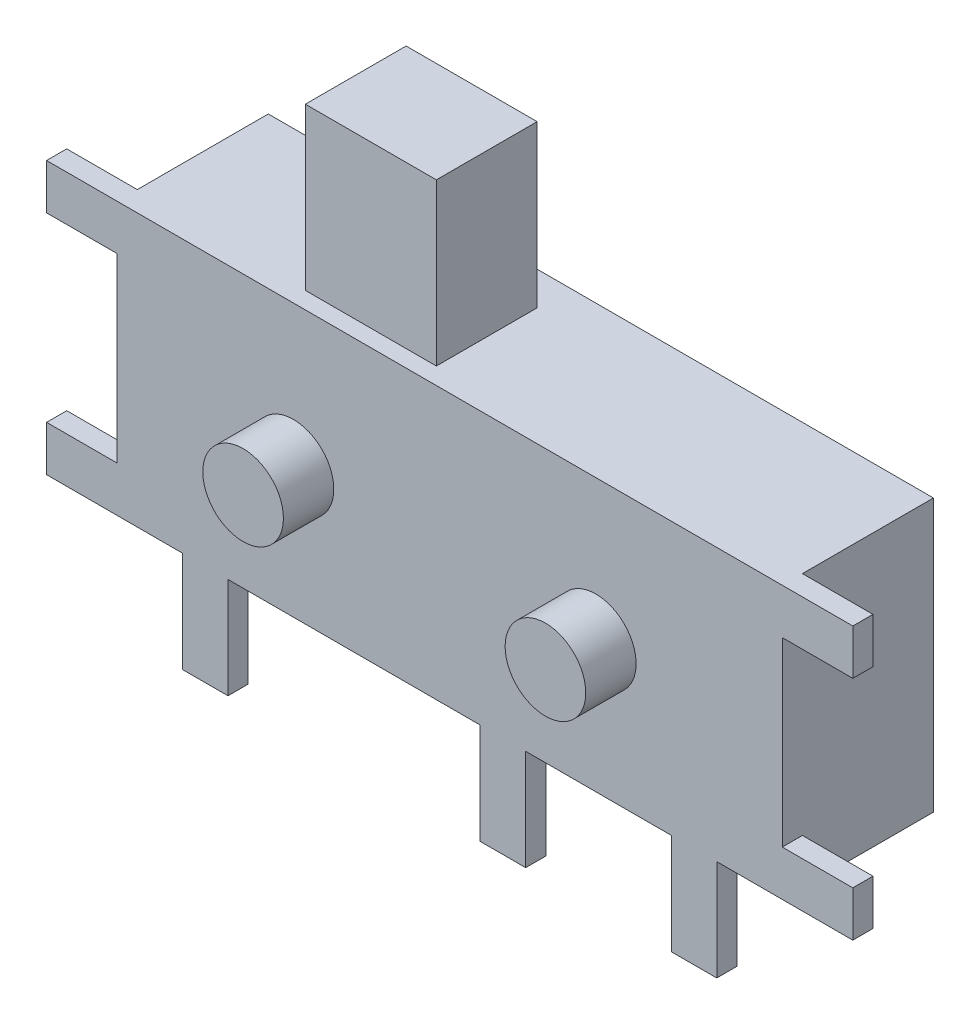
ISO-10303-21;
HEADER;
FILE_DESCRIPTION(('STEP AP214'),'2;1');
FILE_NAME('part.step','',(''),(''),'','','');
FILE_SCHEMA(('AUTOMOTIVE_DESIGN { 1 0 10303 214 1 1 1 1 }'));
ENDSEC;
DATA;
#1=APPLICATION_CONTEXT('core data for automotive mechanical design processes');
#2=APPLICATION_PROTOCOL_DEFINITION('international standard','automotive_design',2000,#1);
#3=PRODUCT_CONTEXT('',#1,'mechanical');
#4=PRODUCT('Part','Part','',(#3));
#5=PRODUCT_RELATED_PRODUCT_CATEGORY('part','',(#4));
#6=PRODUCT_DEFINITION_FORMATION('','',#4);
#7=PRODUCT_DEFINITION_CONTEXT('part definition',#1,'design');
#8=PRODUCT_DEFINITION('design','',#6,#7);
#9=PRODUCT_DEFINITION_SHAPE('','',#8);
#10=(LENGTH_UNIT() NAMED_UNIT(*) SI_UNIT(.MILLI.,.METRE.));
#11=(NAMED_UNIT(*) PLANE_ANGLE_UNIT() SI_UNIT($,.RADIAN.));
#12=(NAMED_UNIT(*) SI_UNIT($,.STERADIAN.) SOLID_ANGLE_UNIT());
#13=UNCERTAINTY_MEASURE_WITH_UNIT(LENGTH_MEASURE(1.E-05),#10,'distance_accuracy_value','');
#14=(GEOMETRIC_REPRESENTATION_CONTEXT(3) GLOBAL_UNCERTAINTY_ASSIGNED_CONTEXT((#13)) GLOBAL_UNIT_ASSIGNED_CONTEXT((#10,
#11,#12)) REPRESENTATION_CONTEXT('',''));
#15=CARTESIAN_POINT('',(0.,0.,0.));
#16=DIRECTION('',(0.,0.,1.));
#17=DIRECTION('',(1.,0.,0.));
#18=AXIS2_PLACEMENT_3D('',#15,#16,#17);
#19=CARTESIAN_POINT('',(3.3,-1.35,-1.5));
#20=DIRECTION('',(1.,0.,0.));
#21=DIRECTION('',(0.,0.,-1.));
#22=AXIS2_PLACEMENT_3D('',#19,#20,#21);
#23=PLANE('',#22);
#24=DIRECTION('',(0.,0.,1.));
#25=VECTOR('',#24,1.);
#26=CARTESIAN_POINT('',(3.3,-0.900000000000001,-0.2));
#27=LINE('',#26,#25);
#28=CARTESIAN_POINT('',(3.3,-0.900000000000001,-0.2));
#29=VERTEX_POINT('',#28);
#30=CARTESIAN_POINT('',(3.3,-0.900000000000001,0.));
#31=VERTEX_POINT('',#30);
#32=EDGE_CURVE('E403',#29,#31,#27,.T.);
#33=ORIENTED_EDGE('',*,*,#32,.F.);
#34=DIRECTION('',(0.,-1.,0.));
#35=VECTOR('',#34,1.);
#36=CARTESIAN_POINT('',(3.3,-1.35,-0.2));
#37=LINE('',#36,#35);
#38=CARTESIAN_POINT('',(3.3,-1.35,-0.2));
#39=VERTEX_POINT('',#38);
#40=EDGE_CURVE('E386',#29,#39,#37,.T.);
#41=ORIENTED_EDGE('',*,*,#40,.T.);
#42=DIRECTION('',(0.,0.,1.));
#43=VECTOR('',#42,1.);
#44=CARTESIAN_POINT('',(3.3,-1.35,-1.5));
#45=LINE('',#44,#43);
#46=CARTESIAN_POINT('',(3.3,-1.35,-1.5));
#47=VERTEX_POINT('',#46);
#48=EDGE_CURVE('E487',#47,#39,#45,.T.);
#49=ORIENTED_EDGE('',*,*,#48,.F.);
#50=DIRECTION('',(0.,1.,0.));
#51=VECTOR('',#50,1.);
#52=CARTESIAN_POINT('',(3.3,-1.35,-1.5));
#53=LINE('',#52,#51);
#54=CARTESIAN_POINT('',(3.3,1.35,-1.5));
#55=VERTEX_POINT('',#54);
#56=EDGE_CURVE('E462',#47,#55,#53,.T.);
#57=ORIENTED_EDGE('',*,*,#56,.T.);
#58=DIRECTION('',(0.,0.,1.));
#59=VECTOR('',#58,1.);
#60=CARTESIAN_POINT('',(3.3,1.35,-1.5));
#61=LINE('',#60,#59);
#62=CARTESIAN_POINT('',(3.3,1.35,-0.2));
#63=VERTEX_POINT('',#62);
#64=EDGE_CURVE('E475',#55,#63,#61,.T.);
#65=ORIENTED_EDGE('',*,*,#64,.T.);
#66=DIRECTION('',(0.,-1.,0.));
#67=VECTOR('',#66,1.);
#68=CARTESIAN_POINT('',(3.3,1.35,-0.2));
#69=LINE('',#68,#67);
#70=CARTESIAN_POINT('',(3.3,0.9,-0.2));
#71=VERTEX_POINT('',#70);
#72=EDGE_CURVE('E414',#63,#71,#69,.T.);
#73=ORIENTED_EDGE('',*,*,#72,.T.);
#74=DIRECTION('',(0.,0.,1.));
#75=VECTOR('',#74,1.);
#76=CARTESIAN_POINT('',(3.3,0.9,-0.2));
#77=LINE('',#76,#75);
#78=CARTESIAN_POINT('',(3.3,0.899999999999999,0.));
#79=VERTEX_POINT('',#78);
#80=EDGE_CURVE('E424',#71,#79,#77,.T.);
#81=ORIENTED_EDGE('',*,*,#80,.T.);
#82=DIRECTION('',(0.,1.,0.));
#83=VECTOR('',#82,1.);
#84=CARTESIAN_POINT('',(3.3,-1.35,0.));
#85=LINE('',#84,#83);
#86=EDGE_CURVE('E457',#31,#79,#85,.T.);
#87=ORIENTED_EDGE('',*,*,#86,.F.);
#88=EDGE_LOOP('',(#33,#41,#49,#57,#65,#73,#81,#87));
#89=FACE_BOUND('',#88,.T.);
#90=ADVANCED_FACE('F36',(#89),#23,.T.);
#91=CARTESIAN_POINT('',(-3.3,-1.35,-1.5));
#92=DIRECTION('',(0.,-1.,0.));
#93=DIRECTION('',(0.,0.,-1.));
#94=AXIS2_PLACEMENT_3D('',#91,#92,#93);
#95=PLANE('',#94);
#96=DIRECTION('',(0.,0.,1.));
#97=VECTOR('',#96,1.);
#98=CARTESIAN_POINT('',(0.754045219724622,-1.35,-0.2));
#99=LINE('',#98,#97);
#100=CARTESIAN_POINT('',(0.754045219724622,-1.35,-0.2));
#101=VERTEX_POINT('',#100);
#102=CARTESIAN_POINT('',(0.754045219724621,-1.35,0.));
#103=VERTEX_POINT('',#102);
#104=EDGE_CURVE('E284',#101,#103,#99,.T.);
#105=ORIENTED_EDGE('',*,*,#104,.F.);
#106=DIRECTION('',(-1.,0.,0.));
#107=VECTOR('',#106,1.);
#108=CARTESIAN_POINT('',(0.754045219724622,-1.35,-0.2));
#109=LINE('',#108,#107);
#110=CARTESIAN_POINT('',(0.3,-1.35,-0.2));
#111=VERTEX_POINT('',#110);
#112=EDGE_CURVE('E275',#101,#111,#109,.T.);
#113=ORIENTED_EDGE('',*,*,#112,.T.);
#114=DIRECTION('',(0.,0.,1.));
#115=VECTOR('',#114,1.);
#116=CARTESIAN_POINT('',(0.3,-1.35,-0.2));
#117=LINE('',#116,#115);
#118=CARTESIAN_POINT('',(0.3,-1.35,0.));
#119=VERTEX_POINT('',#118);
#120=EDGE_CURVE('E295',#111,#119,#117,.T.);
#121=ORIENTED_EDGE('',*,*,#120,.T.);
#122=DIRECTION('',(1.,0.,0.));
#123=VECTOR('',#122,1.);
#124=CARTESIAN_POINT('',(-3.3,-1.35,0.));
#125=LINE('',#124,#123);
#126=CARTESIAN_POINT('',(-2.2,-1.35,0.));
#127=VERTEX_POINT('',#126);
#128=EDGE_CURVE('E485',#127,#119,#125,.T.);
#129=ORIENTED_EDGE('',*,*,#128,.F.);
#130=DIRECTION('',(0.,0.,1.));
#131=VECTOR('',#130,1.);
#132=CARTESIAN_POINT('',(-2.2,-1.35,-0.2));
#133=LINE('',#132,#131);
#134=CARTESIAN_POINT('',(-2.2,-1.35,-0.2));
#135=VERTEX_POINT('',#134);
#136=EDGE_CURVE('E320',#135,#127,#133,.T.);
#137=ORIENTED_EDGE('',*,*,#136,.F.);
#138=DIRECTION('',(-1.,0.,0.));
#139=VECTOR('',#138,1.);
#140=CARTESIAN_POINT('',(-2.65,-1.35,-0.2));
#141=LINE('',#140,#139);
#142=CARTESIAN_POINT('',(-2.65,-1.35,-0.2));
#143=VERTEX_POINT('',#142);
#144=EDGE_CURVE('E300',#135,#143,#141,.T.);
#145=ORIENTED_EDGE('',*,*,#144,.T.);
#146=DIRECTION('',(0.,0.,1.));
#147=VECTOR('',#146,1.);
#148=CARTESIAN_POINT('',(-2.65,-1.35,-0.2));
#149=LINE('',#148,#147);
#150=CARTESIAN_POINT('',(-2.65,-1.35,0.));
#151=VERTEX_POINT('',#150);
#152=EDGE_CURVE('E313',#143,#151,#149,.T.);
#153=ORIENTED_EDGE('',*,*,#152,.T.);
#154=CARTESIAN_POINT('',(-4.,-1.35,0.));
#155=VERTEX_POINT('',#154);
#156=EDGE_CURVE('E466',#155,#151,#125,.T.);
#157=ORIENTED_EDGE('',*,*,#156,.F.);
#158=DIRECTION('',(0.,0.,1.));
#159=VECTOR('',#158,1.);
#160=CARTESIAN_POINT('',(-4.,-1.35,-0.2));
#161=LINE('',#160,#159);
#162=CARTESIAN_POINT('',(-4.,-1.35,-0.2));
#163=VERTEX_POINT('',#162);
#164=EDGE_CURVE('E378',#163,#155,#161,.T.);
#165=ORIENTED_EDGE('',*,*,#164,.F.);
#166=DIRECTION('',(1.,0.,0.));
#167=VECTOR('',#166,1.);
#168=CARTESIAN_POINT('',(-3.3,-1.35,-0.2));
#169=LINE('',#168,#167);
#170=CARTESIAN_POINT('',(-3.3,-1.35,-0.2));
#171=VERTEX_POINT('',#170);
#172=EDGE_CURVE('E360',#163,#171,#169,.T.);
#173=ORIENTED_EDGE('',*,*,#172,.T.);
#174=DIRECTION('',(0.,0.,1.));
#175=VECTOR('',#174,1.);
#176=CARTESIAN_POINT('',(-3.3,-1.35,-1.5));
#177=LINE('',#176,#175);
#178=CARTESIAN_POINT('',(-3.3,-1.35,-1.5));
#179=VERTEX_POINT('',#178);
#180=EDGE_CURVE('E490',#179,#171,#177,.T.);
#181=ORIENTED_EDGE('',*,*,#180,.F.);
#182=DIRECTION('',(1.,0.,0.));
#183=VECTOR('',#182,1.);
#184=CARTESIAN_POINT('',(-3.3,-1.35,-1.5));
#185=LINE('',#184,#183);
#186=EDGE_CURVE('E472',#179,#47,#185,.T.);
#187=ORIENTED_EDGE('',*,*,#186,.T.);
#188=ORIENTED_EDGE('',*,*,#48,.T.);
#189=DIRECTION('',(1.,0.,0.));
#190=VECTOR('',#189,1.);
#191=CARTESIAN_POINT('',(3.3,-1.35,-0.2));
#192=LINE('',#191,#190);
#193=CARTESIAN_POINT('',(4.,-1.35,-0.2));
#194=VERTEX_POINT('',#193);
#195=EDGE_CURVE('E389',#39,#194,#192,.T.);
#196=ORIENTED_EDGE('',*,*,#195,.T.);
#197=DIRECTION('',(0.,0.,1.));
#198=VECTOR('',#197,1.);
#199=CARTESIAN_POINT('',(4.,-1.35,-0.2));
#200=LINE('',#199,#198);
#201=CARTESIAN_POINT('',(4.,-1.35,0.));
#202=VERTEX_POINT('',#201);
#203=EDGE_CURVE('E399',#194,#202,#200,.T.);
#204=ORIENTED_EDGE('',*,*,#203,.T.);
#205=CARTESIAN_POINT('',(2.65,-1.35,0.));
#206=VERTEX_POINT('',#205);
#207=EDGE_CURVE('E482',#206,#202,#125,.T.);
#208=ORIENTED_EDGE('',*,*,#207,.F.);
#209=DIRECTION('',(0.,0.,1.));
#210=VECTOR('',#209,1.);
#211=CARTESIAN_POINT('',(2.65,-1.35,-0.2));
#212=LINE('',#211,#210);
#213=CARTESIAN_POINT('',(2.65,-1.35,-0.2));
#214=VERTEX_POINT('',#213);
#215=EDGE_CURVE('E343',#214,#206,#212,.T.);
#216=ORIENTED_EDGE('',*,*,#215,.F.);
#217=DIRECTION('',(-1.,0.,0.));
#218=VECTOR('',#217,1.);
#219=CARTESIAN_POINT('',(2.65,-1.35,-0.2));
#220=LINE('',#219,#218);
#221=CARTESIAN_POINT('',(2.2,-1.35,-0.2));
#222=VERTEX_POINT('',#221);
#223=EDGE_CURVE('E333',#214,#222,#220,.T.);
#224=ORIENTED_EDGE('',*,*,#223,.T.);
#225=DIRECTION('',(0.,0.,1.));
#226=VECTOR('',#225,1.);
#227=CARTESIAN_POINT('',(2.2,-1.35,-0.2));
#228=LINE('',#227,#226);
#229=CARTESIAN_POINT('',(2.2,-1.35,0.));
#230=VERTEX_POINT('',#229);
#231=EDGE_CURVE('E356',#222,#230,#228,.T.);
#232=ORIENTED_EDGE('',*,*,#231,.T.);
#233=EDGE_CURVE('E486',#103,#230,#125,.T.);
#234=ORIENTED_EDGE('',*,*,#233,.F.);
#235=EDGE_LOOP('',(#105,#113,#121,#129,#137,#145,#153,#157,#165,#173,#181,#187,#188,#196,#204,
#208,#216,#224,#232,#234));
#236=FACE_BOUND('',#235,.T.);
#237=ADVANCED_FACE('F512',(#236),#95,.T.);
#238=CARTESIAN_POINT('',(-3.3,-1.35,-1.5));
#239=DIRECTION('',(-1.,0.,0.));
#240=DIRECTION('',(0.,0.,1.));
#241=AXIS2_PLACEMENT_3D('',#238,#239,#240);
#242=PLANE('',#241);
#243=DIRECTION('',(0.,0.,1.));
#244=VECTOR('',#243,1.);
#245=CARTESIAN_POINT('',(-3.3,-0.900000000000001,-0.2));
#246=LINE('',#245,#244);
#247=CARTESIAN_POINT('',(-3.3,-0.900000000000001,-0.2));
#248=VERTEX_POINT('',#247);
#249=CARTESIAN_POINT('',(-3.3,-0.900000000000001,0.));
#250=VERTEX_POINT('',#249);
#251=EDGE_CURVE('E373',#248,#250,#246,.T.);
#252=ORIENTED_EDGE('',*,*,#251,.T.);
#253=DIRECTION('',(0.,-1.,0.));
#254=VECTOR('',#253,1.);
#255=CARTESIAN_POINT('',(-3.3,-1.35,0.));
#256=LINE('',#255,#254);
#257=CARTESIAN_POINT('',(-3.3,0.9,0.));
#258=VERTEX_POINT('',#257);
#259=EDGE_CURVE('E479',#258,#250,#256,.T.);
#260=ORIENTED_EDGE('',*,*,#259,.F.);
#261=DIRECTION('',(0.,0.,1.));
#262=VECTOR('',#261,1.);
#263=CARTESIAN_POINT('',(-3.3,0.9,-0.2));
#264=LINE('',#263,#262);
#265=CARTESIAN_POINT('',(-3.3,0.9,-0.2));
#266=VERTEX_POINT('',#265);
#267=EDGE_CURVE('E455',#266,#258,#264,.T.);
#268=ORIENTED_EDGE('',*,*,#267,.F.);
#269=DIRECTION('',(0.,1.,0.));
#270=VECTOR('',#269,1.);
#271=CARTESIAN_POINT('',(-3.3,1.35,-0.2));
#272=LINE('',#271,#270);
#273=CARTESIAN_POINT('',(-3.3,1.35,-0.2));
#274=VERTEX_POINT('',#273);
#275=EDGE_CURVE('E437',#266,#274,#272,.T.);
#276=ORIENTED_EDGE('',*,*,#275,.T.);
#277=DIRECTION('',(0.,0.,1.));
#278=VECTOR('',#277,1.);
#279=CARTESIAN_POINT('',(-3.3,1.35,-1.5));
#280=LINE('',#279,#278);
#281=CARTESIAN_POINT('',(-3.3,1.35,-1.5));
#282=VERTEX_POINT('',#281);
#283=EDGE_CURVE('E493',#282,#274,#280,.T.);
#284=ORIENTED_EDGE('',*,*,#283,.F.);
#285=DIRECTION('',(0.,-1.,0.));
#286=VECTOR('',#285,1.);
#287=CARTESIAN_POINT('',(-3.3,-1.35,-1.5));
#288=LINE('',#287,#286);
#289=EDGE_CURVE('E469',#282,#179,#288,.T.);
#290=ORIENTED_EDGE('',*,*,#289,.T.);
#291=ORIENTED_EDGE('',*,*,#180,.T.);
#292=DIRECTION('',(0.,1.,0.));
#293=VECTOR('',#292,1.);
#294=CARTESIAN_POINT('',(-3.3,-1.35,-0.2));
#295=LINE('',#294,#293);
#296=EDGE_CURVE('E363',#171,#248,#295,.T.);
#297=ORIENTED_EDGE('',*,*,#296,.T.);
#298=EDGE_LOOP('',(#252,#260,#268,#276,#284,#290,#291,#297));
#299=FACE_BOUND('',#298,.T.);
#300=ADVANCED_FACE('F521',(#299),#242,.T.);
#301=CARTESIAN_POINT('',(-3.3,1.35,-1.5));
#302=DIRECTION('',(0.,1.,0.));
#303=DIRECTION('',(0.,0.,1.));
#304=AXIS2_PLACEMENT_3D('',#301,#302,#303);
#305=PLANE('',#304);
#306=DIRECTION('',(0.,0.,1.));
#307=VECTOR('',#306,1.);
#308=CARTESIAN_POINT('',(-1.6,1.35,-1.16769331279504));
#309=LINE('',#308,#307);
#310=CARTESIAN_POINT('',(-1.6,1.35,-1.16769331279504));
#311=VERTEX_POINT('',#310);
#312=CARTESIAN_POINT('',(-1.6,1.35,-0.167693312795038));
#313=VERTEX_POINT('',#312);
#314=EDGE_CURVE('E50',#311,#313,#309,.T.);
#315=ORIENTED_EDGE('',*,*,#314,.F.);
#316=DIRECTION('',(-1.,0.,0.));
#317=VECTOR('',#316,1.);
#318=CARTESIAN_POINT('',(-1.6,1.35,-1.16769331279504));
#319=LINE('',#318,#317);
#320=CARTESIAN_POINT('',(-0.3,1.35,-1.16769331279504));
#321=VERTEX_POINT('',#320);
#322=EDGE_CURVE('E54',#321,#311,#319,.T.);
#323=ORIENTED_EDGE('',*,*,#322,.F.);
#324=DIRECTION('',(0.,0.,-1.));
#325=VECTOR('',#324,1.);
#326=CARTESIAN_POINT('',(-0.3,1.35,-1.16769331279504));
#327=LINE('',#326,#325);
#328=CARTESIAN_POINT('',(-0.3,1.35,-0.167693312795038));
#329=VERTEX_POINT('',#328);
#330=EDGE_CURVE('E873',#329,#321,#327,.T.);
#331=ORIENTED_EDGE('',*,*,#330,.F.);
#332=DIRECTION('',(1.,0.,0.));
#333=VECTOR('',#332,1.);
#334=CARTESIAN_POINT('',(-1.6,1.35,-0.167693312795038));
#335=LINE('',#334,#333);
#336=EDGE_CURVE('E871',#313,#329,#335,.T.);
#337=ORIENTED_EDGE('',*,*,#336,.F.);
#338=EDGE_LOOP('',(#315,#323,#331,#337));
#339=FACE_BOUND('',#338,.T.);
#340=DIRECTION('',(-1.,0.,0.));
#341=VECTOR('',#340,1.);
#342=CARTESIAN_POINT('',(-3.3,1.35,0.));
#343=LINE('',#342,#341);
#344=CARTESIAN_POINT('',(4.,1.35,0.));
#345=VERTEX_POINT('',#344);
#346=CARTESIAN_POINT('',(-4.,1.35,0.));
#347=VERTEX_POINT('',#346);
#348=EDGE_CURVE('E477',#345,#347,#343,.T.);
#349=ORIENTED_EDGE('',*,*,#348,.F.);
#350=DIRECTION('',(0.,0.,1.));
#351=VECTOR('',#350,1.);
#352=CARTESIAN_POINT('',(4.,1.35,-0.2));
#353=LINE('',#352,#351);
#354=CARTESIAN_POINT('',(4.,1.35,-0.2));
#355=VERTEX_POINT('',#354);
#356=EDGE_CURVE('E429',#355,#345,#353,.T.);
#357=ORIENTED_EDGE('',*,*,#356,.F.);
#358=DIRECTION('',(-1.,0.,0.));
#359=VECTOR('',#358,1.);
#360=CARTESIAN_POINT('',(3.3,1.35,-0.2));
#361=LINE('',#360,#359);
#362=EDGE_CURVE('E411',#355,#63,#361,.T.);
#363=ORIENTED_EDGE('',*,*,#362,.T.);
#364=ORIENTED_EDGE('',*,*,#64,.F.);
#365=DIRECTION('',(-1.,0.,0.));
#366=VECTOR('',#365,1.);
#367=CARTESIAN_POINT('',(-3.3,1.35,-1.5));
#368=LINE('',#367,#366);
#369=EDGE_CURVE('E465',#55,#282,#368,.T.);
#370=ORIENTED_EDGE('',*,*,#369,.T.);
#371=ORIENTED_EDGE('',*,*,#283,.T.);
#372=DIRECTION('',(-1.,0.,0.));
#373=VECTOR('',#372,1.);
#374=CARTESIAN_POINT('',(-3.3,1.35,-0.2));
#375=LINE('',#374,#373);
#376=CARTESIAN_POINT('',(-4.,1.35,-0.2));
#377=VERTEX_POINT('',#376);
#378=EDGE_CURVE('E440',#274,#377,#375,.T.);
#379=ORIENTED_EDGE('',*,*,#378,.T.);
#380=DIRECTION('',(0.,0.,1.));
#381=VECTOR('',#380,1.);
#382=CARTESIAN_POINT('',(-4.,1.35,-0.2));
#383=LINE('',#382,#381);
#384=EDGE_CURVE('E450',#377,#347,#383,.T.);
#385=ORIENTED_EDGE('',*,*,#384,.T.);
#386=EDGE_LOOP('',(#349,#357,#363,#364,#370,#371,#379,#385));
#387=FACE_BOUND('',#386,.T.);
#388=ADVANCED_FACE('F592',(#339,#387),#305,.T.);
#389=CARTESIAN_POINT('',(0.,0.,-1.5));
#390=DIRECTION('',(0.,0.,-1.));
#391=DIRECTION('',(-1.,0.,0.));
#392=AXIS2_PLACEMENT_3D('',#389,#390,#391);
#393=PLANE('',#392);
#394=ORIENTED_EDGE('',*,*,#56,.F.);
#395=ORIENTED_EDGE('',*,*,#186,.F.);
#396=ORIENTED_EDGE('',*,*,#289,.F.);
#397=ORIENTED_EDGE('',*,*,#369,.F.);
#398=EDGE_LOOP('',(#394,#395,#396,#397));
#399=FACE_BOUND('',#398,.T.);
#400=ADVANCED_FACE('F506',(#399),#393,.T.);
#401=CARTESIAN_POINT('',(0.,0.,0.));
#402=DIRECTION('',(0.,0.,-1.));
#403=DIRECTION('',(-1.,0.,0.));
#404=AXIS2_PLACEMENT_3D('',#401,#402,#403);
#405=PLANE('',#404);
#406=CARTESIAN_POINT('',(-1.55,-0.0500000000000211,0.));
#407=DIRECTION('',(0.,0.,-1.));
#408=DIRECTION('',(-1.,0.,0.));
#409=AXIS2_PLACEMENT_3D('',#406,#407,#408);
#410=CIRCLE('',#409,0.4);
#411=CARTESIAN_POINT('',(-1.95,-0.0500000000000211,0.));
#412=VERTEX_POINT('',#411);
#413=EDGE_CURVE('E11',#412,#412,#410,.F.);
#414=ORIENTED_EDGE('',*,*,#413,.F.);
#415=EDGE_LOOP('',(#414));
#416=FACE_BOUND('',#415,.T.);
#417=CARTESIAN_POINT('',(1.45,-0.0500000000000001,0.));
#418=DIRECTION('',(0.,0.,-1.));
#419=DIRECTION('',(-1.,0.,0.));
#420=AXIS2_PLACEMENT_3D('',#417,#418,#419);
#421=CIRCLE('',#420,0.4);
#422=CARTESIAN_POINT('',(1.05,-0.0500000000000001,0.));
#423=VERTEX_POINT('',#422);
#424=EDGE_CURVE('E43',#423,#423,#421,.F.);
#425=ORIENTED_EDGE('',*,*,#424,.F.);
#426=EDGE_LOOP('',(#425));
#427=FACE_BOUND('',#426,.T.);
#428=ORIENTED_EDGE('',*,*,#156,.T.);
#429=DIRECTION('',(0.,-1.,0.));
#430=VECTOR('',#429,1.);
#431=CARTESIAN_POINT('',(-2.65,-1.35,0.));
#432=LINE('',#431,#430);
#433=CARTESIAN_POINT('',(-2.65,-2.35,0.));
#434=VERTEX_POINT('',#433);
#435=EDGE_CURVE('E292',#151,#434,#432,.T.);
#436=ORIENTED_EDGE('',*,*,#435,.T.);
#437=DIRECTION('',(1.,0.,0.));
#438=VECTOR('',#437,1.);
#439=CARTESIAN_POINT('',(-2.65,-2.35,0.));
#440=LINE('',#439,#438);
#441=CARTESIAN_POINT('',(-2.2,-2.35,0.));
#442=VERTEX_POINT('',#441);
#443=EDGE_CURVE('E316',#434,#442,#440,.T.);
#444=ORIENTED_EDGE('',*,*,#443,.T.);
#445=DIRECTION('',(0.,1.,0.));
#446=VECTOR('',#445,1.);
#447=CARTESIAN_POINT('',(-2.2,-1.35,0.));
#448=LINE('',#447,#446);
#449=EDGE_CURVE('E304',#442,#127,#448,.T.);
#450=ORIENTED_EDGE('',*,*,#449,.T.);
#451=ORIENTED_EDGE('',*,*,#128,.T.);
#452=DIRECTION('',(0.,-1.,0.));
#453=VECTOR('',#452,1.);
#454=CARTESIAN_POINT('',(0.3,-1.35,0.));
#455=LINE('',#454,#453);
#456=CARTESIAN_POINT('',(0.3,-2.35,0.));
#457=VERTEX_POINT('',#456);
#458=EDGE_CURVE('E266',#119,#457,#455,.T.);
#459=ORIENTED_EDGE('',*,*,#458,.T.);
#460=DIRECTION('',(1.,0.,0.));
#461=VECTOR('',#460,1.);
#462=CARTESIAN_POINT('',(0.754045219724622,-2.35,0.));
#463=LINE('',#462,#461);
#464=CARTESIAN_POINT('',(0.754045219724622,-2.35,0.));
#465=VERTEX_POINT('',#464);
#466=EDGE_CURVE('E276',#457,#465,#463,.T.);
#467=ORIENTED_EDGE('',*,*,#466,.T.);
#468=DIRECTION('',(0.,1.,0.));
#469=VECTOR('',#468,1.);
#470=CARTESIAN_POINT('',(0.754045219724622,-1.35,0.));
#471=LINE('',#470,#469);
#472=EDGE_CURVE('E264',#465,#103,#471,.T.);
#473=ORIENTED_EDGE('',*,*,#472,.T.);
#474=ORIENTED_EDGE('',*,*,#233,.T.);
#475=DIRECTION('',(0.,-1.,0.));
#476=VECTOR('',#475,1.);
#477=CARTESIAN_POINT('',(2.2,-1.35,0.));
#478=LINE('',#477,#476);
#479=CARTESIAN_POINT('',(2.2,-2.35,0.));
#480=VERTEX_POINT('',#479);
#481=EDGE_CURVE('E346',#230,#480,#478,.T.);
#482=ORIENTED_EDGE('',*,*,#481,.T.);
#483=DIRECTION('',(1.,0.,0.));
#484=VECTOR('',#483,1.);
#485=CARTESIAN_POINT('',(2.65,-2.35,0.));
#486=LINE('',#485,#484);
#487=CARTESIAN_POINT('',(2.65,-2.35,0.));
#488=VERTEX_POINT('',#487);
#489=EDGE_CURVE('E334',#480,#488,#486,.T.);
#490=ORIENTED_EDGE('',*,*,#489,.T.);
#491=DIRECTION('',(0.,1.,0.));
#492=VECTOR('',#491,1.);
#493=CARTESIAN_POINT('',(2.65,-1.35,0.));
#494=LINE('',#493,#492);
#495=EDGE_CURVE('E323',#488,#206,#494,.T.);
#496=ORIENTED_EDGE('',*,*,#495,.T.);
#497=ORIENTED_EDGE('',*,*,#207,.T.);
#498=DIRECTION('',(0.,1.,0.));
#499=VECTOR('',#498,1.);
#500=CARTESIAN_POINT('',(4.,-1.35,0.));
#501=LINE('',#500,#499);
#502=CARTESIAN_POINT('',(4.,-0.900000000000001,0.));
#503=VERTEX_POINT('',#502);
#504=EDGE_CURVE('E381',#202,#503,#501,.T.);
#505=ORIENTED_EDGE('',*,*,#504,.T.);
#506=DIRECTION('',(-1.,0.,0.));
#507=VECTOR('',#506,1.);
#508=CARTESIAN_POINT('',(3.3,-0.900000000000001,0.));
#509=LINE('',#508,#507);
#510=EDGE_CURVE('E390',#503,#31,#509,.T.);
#511=ORIENTED_EDGE('',*,*,#510,.T.);
#512=ORIENTED_EDGE('',*,*,#86,.T.);
#513=DIRECTION('',(1.,0.,0.));
#514=VECTOR('',#513,1.);
#515=CARTESIAN_POINT('',(3.3,0.9,0.));
#516=LINE('',#515,#514);
#517=CARTESIAN_POINT('',(4.,0.9,0.));
#518=VERTEX_POINT('',#517);
#519=EDGE_CURVE('E406',#79,#518,#516,.T.);
#520=ORIENTED_EDGE('',*,*,#519,.T.);
#521=DIRECTION('',(0.,1.,0.));
#522=VECTOR('',#521,1.);
#523=CARTESIAN_POINT('',(4.,1.35,0.));
#524=LINE('',#523,#522);
#525=EDGE_CURVE('E415',#518,#345,#524,.T.);
#526=ORIENTED_EDGE('',*,*,#525,.T.);
#527=ORIENTED_EDGE('',*,*,#348,.T.);
#528=DIRECTION('',(0.,-1.,0.));
#529=VECTOR('',#528,1.);
#530=CARTESIAN_POINT('',(-4.,1.35,0.));
#531=LINE('',#530,#529);
#532=CARTESIAN_POINT('',(-4.,0.9,0.));
#533=VERTEX_POINT('',#532);
#534=EDGE_CURVE('E432',#347,#533,#531,.T.);
#535=ORIENTED_EDGE('',*,*,#534,.T.);
#536=DIRECTION('',(1.,0.,0.));
#537=VECTOR('',#536,1.);
#538=CARTESIAN_POINT('',(-3.3,0.9,0.));
#539=LINE('',#538,#537);
#540=EDGE_CURVE('E441',#533,#258,#539,.T.);
#541=ORIENTED_EDGE('',*,*,#540,.T.);
#542=ORIENTED_EDGE('',*,*,#259,.T.);
#543=DIRECTION('',(-1.,0.,0.));
#544=VECTOR('',#543,1.);
#545=CARTESIAN_POINT('',(-3.3,-0.900000000000001,0.));
#546=LINE('',#545,#544);
#547=CARTESIAN_POINT('',(-4.,-0.900000000000001,0.));
#548=VERTEX_POINT('',#547);
#549=EDGE_CURVE('E353',#250,#548,#546,.T.);
#550=ORIENTED_EDGE('',*,*,#549,.T.);
#551=DIRECTION('',(0.,-1.,0.));
#552=VECTOR('',#551,1.);
#553=CARTESIAN_POINT('',(-4.,-1.35,0.));
#554=LINE('',#553,#552);
#555=EDGE_CURVE('E364',#548,#155,#554,.T.);
#556=ORIENTED_EDGE('',*,*,#555,.T.);
#557=EDGE_LOOP('',(#428,#436,#444,#450,#451,#459,#467,#473,#474,#482,#490,#496,#497,#505,#511,
#512,#520,#526,#527,#535,#541,#542,#550,#556));
#558=FACE_BOUND('',#557,.T.);
#559=ADVANCED_FACE('F502',(#416,#427,#558),#405,.F.);
#560=CARTESIAN_POINT('',(-3.3,0.9,-0.2));
#561=DIRECTION('',(0.,-1.,0.));
#562=DIRECTION('',(0.,0.,-1.));
#563=AXIS2_PLACEMENT_3D('',#560,#561,#562);
#564=PLANE('',#563);
#565=ORIENTED_EDGE('',*,*,#540,.F.);
#566=DIRECTION('',(0.,0.,1.));
#567=VECTOR('',#566,1.);
#568=CARTESIAN_POINT('',(-4.,0.9,-0.2));
#569=LINE('',#568,#567);
#570=CARTESIAN_POINT('',(-4.,0.9,-0.2));
#571=VERTEX_POINT('',#570);
#572=EDGE_CURVE('E458',#571,#533,#569,.T.);
#573=ORIENTED_EDGE('',*,*,#572,.F.);
#574=DIRECTION('',(1.,0.,0.));
#575=VECTOR('',#574,1.);
#576=CARTESIAN_POINT('',(-3.3,0.9,-0.2));
#577=LINE('',#576,#575);
#578=EDGE_CURVE('E447',#571,#266,#577,.T.);
#579=ORIENTED_EDGE('',*,*,#578,.T.);
#580=ORIENTED_EDGE('',*,*,#267,.T.);
#581=EDGE_LOOP('',(#565,#573,#579,#580));
#582=FACE_BOUND('',#581,.T.);
#583=ADVANCED_FACE('F505',(#582),#564,.T.);
#584=CARTESIAN_POINT('',(-4.,1.35,-0.2));
#585=DIRECTION('',(-1.,0.,0.));
#586=DIRECTION('',(0.,-1.,0.));
#587=AXIS2_PLACEMENT_3D('',#584,#585,#586);
#588=PLANE('',#587);
#589=ORIENTED_EDGE('',*,*,#534,.F.);
#590=ORIENTED_EDGE('',*,*,#384,.F.);
#591=DIRECTION('',(0.,-1.,0.));
#592=VECTOR('',#591,1.);
#593=CARTESIAN_POINT('',(-4.,1.35,-0.2));
#594=LINE('',#593,#592);
#595=EDGE_CURVE('E444',#377,#571,#594,.T.);
#596=ORIENTED_EDGE('',*,*,#595,.T.);
#597=ORIENTED_EDGE('',*,*,#572,.T.);
#598=EDGE_LOOP('',(#589,#590,#596,#597));
#599=FACE_BOUND('',#598,.T.);
#600=ADVANCED_FACE('F621',(#599),#588,.T.);
#601=CARTESIAN_POINT('',(0.,0.,-0.2));
#602=DIRECTION('',(0.,0.,-1.));
#603=DIRECTION('',(-1.,0.,0.));
#604=AXIS2_PLACEMENT_3D('',#601,#602,#603);
#605=PLANE('',#604);
#606=ORIENTED_EDGE('',*,*,#275,.F.);
#607=ORIENTED_EDGE('',*,*,#578,.F.);
#608=ORIENTED_EDGE('',*,*,#595,.F.);
#609=ORIENTED_EDGE('',*,*,#378,.F.);
#610=EDGE_LOOP('',(#606,#607,#608,#609));
#611=FACE_BOUND('',#610,.T.);
#612=ADVANCED_FACE('F614',(#611),#605,.T.);
#613=CARTESIAN_POINT('',(4.,1.35,-0.2));
#614=DIRECTION('',(1.,0.,0.));
#615=DIRECTION('',(0.,1.,0.));
#616=AXIS2_PLACEMENT_3D('',#613,#614,#615);
#617=PLANE('',#616);
#618=ORIENTED_EDGE('',*,*,#525,.F.);
#619=DIRECTION('',(0.,0.,1.));
#620=VECTOR('',#619,1.);
#621=CARTESIAN_POINT('',(4.,0.9,-0.2));
#622=LINE('',#621,#620);
#623=CARTESIAN_POINT('',(4.,0.9,-0.2));
#624=VERTEX_POINT('',#623);
#625=EDGE_CURVE('E433',#624,#518,#622,.T.);
#626=ORIENTED_EDGE('',*,*,#625,.F.);
#627=DIRECTION('',(0.,1.,0.));
#628=VECTOR('',#627,1.);
#629=CARTESIAN_POINT('',(4.,1.35,-0.2));
#630=LINE('',#629,#628);
#631=EDGE_CURVE('E421',#624,#355,#630,.T.);
#632=ORIENTED_EDGE('',*,*,#631,.T.);
#633=ORIENTED_EDGE('',*,*,#356,.T.);
#634=EDGE_LOOP('',(#618,#626,#632,#633));
#635=FACE_BOUND('',#634,.T.);
#636=ADVANCED_FACE('F604',(#635),#617,.T.);
#637=CARTESIAN_POINT('',(3.3,0.9,-0.2));
#638=DIRECTION('',(0.,-1.,0.));
#639=DIRECTION('',(0.,0.,-1.));
#640=AXIS2_PLACEMENT_3D('',#637,#638,#639);
#641=PLANE('',#640);
#642=ORIENTED_EDGE('',*,*,#519,.F.);
#643=ORIENTED_EDGE('',*,*,#80,.F.);
#644=DIRECTION('',(1.,0.,0.));
#645=VECTOR('',#644,1.);
#646=CARTESIAN_POINT('',(3.3,0.9,-0.2));
#647=LINE('',#646,#645);
#648=EDGE_CURVE('E418',#71,#624,#647,.T.);
#649=ORIENTED_EDGE('',*,*,#648,.T.);
#650=ORIENTED_EDGE('',*,*,#625,.T.);
#651=EDGE_LOOP('',(#642,#643,#649,#650));
#652=FACE_BOUND('',#651,.T.);
#653=ADVANCED_FACE('F608',(#652),#641,.T.);
#654=CARTESIAN_POINT('',(0.,0.,-0.2));
#655=DIRECTION('',(0.,0.,-1.));
#656=DIRECTION('',(-1.,0.,0.));
#657=AXIS2_PLACEMENT_3D('',#654,#655,#656);
#658=PLANE('',#657);
#659=ORIENTED_EDGE('',*,*,#362,.F.);
#660=ORIENTED_EDGE('',*,*,#631,.F.);
#661=ORIENTED_EDGE('',*,*,#648,.F.);
#662=ORIENTED_EDGE('',*,*,#72,.F.);
#663=EDGE_LOOP('',(#659,#660,#661,#662));
#664=FACE_BOUND('',#663,.T.);
#665=ADVANCED_FACE('F611',(#664),#658,.T.);
#666=CARTESIAN_POINT('',(3.3,-0.900000000000001,-0.2));
#667=DIRECTION('',(0.,1.,0.));
#668=DIRECTION('',(-1.,0.,0.));
#669=AXIS2_PLACEMENT_3D('',#666,#667,#668);
#670=PLANE('',#669);
#671=ORIENTED_EDGE('',*,*,#510,.F.);
#672=DIRECTION('',(0.,0.,1.));
#673=VECTOR('',#672,1.);
#674=CARTESIAN_POINT('',(4.,-0.900000000000001,-0.2));
#675=LINE('',#674,#673);
#676=CARTESIAN_POINT('',(4.,-0.900000000000001,-0.2));
#677=VERTEX_POINT('',#676);
#678=EDGE_CURVE('E407',#677,#503,#675,.T.);
#679=ORIENTED_EDGE('',*,*,#678,.F.);
#680=DIRECTION('',(-1.,0.,0.));
#681=VECTOR('',#680,1.);
#682=CARTESIAN_POINT('',(3.3,-0.900000000000001,-0.2));
#683=LINE('',#682,#681);
#684=EDGE_CURVE('E396',#677,#29,#683,.T.);
#685=ORIENTED_EDGE('',*,*,#684,.T.);
#686=ORIENTED_EDGE('',*,*,#32,.T.);
#687=EDGE_LOOP('',(#671,#679,#685,#686));
#688=FACE_BOUND('',#687,.T.);
#689=ADVANCED_FACE('F536',(#688),#670,.T.);
#690=CARTESIAN_POINT('',(4.,-1.35,-0.2));
#691=DIRECTION('',(1.,0.,0.));
#692=DIRECTION('',(0.,1.,0.));
#693=AXIS2_PLACEMENT_3D('',#690,#691,#692);
#694=PLANE('',#693);
#695=ORIENTED_EDGE('',*,*,#504,.F.);
#696=ORIENTED_EDGE('',*,*,#203,.F.);
#697=DIRECTION('',(0.,1.,0.));
#698=VECTOR('',#697,1.);
#699=CARTESIAN_POINT('',(4.,-1.35,-0.2));
#700=LINE('',#699,#698);
#701=EDGE_CURVE('E393',#194,#677,#700,.T.);
#702=ORIENTED_EDGE('',*,*,#701,.T.);
#703=ORIENTED_EDGE('',*,*,#678,.T.);
#704=EDGE_LOOP('',(#695,#696,#702,#703));
#705=FACE_BOUND('',#704,.T.);
#706=ADVANCED_FACE('F539',(#705),#694,.T.);
#707=CARTESIAN_POINT('',(0.,0.,-0.2));
#708=DIRECTION('',(0.,0.,-1.));
#709=DIRECTION('',(-1.,0.,0.));
#710=AXIS2_PLACEMENT_3D('',#707,#708,#709);
#711=PLANE('',#710);
#712=ORIENTED_EDGE('',*,*,#40,.F.);
#713=ORIENTED_EDGE('',*,*,#684,.F.);
#714=ORIENTED_EDGE('',*,*,#701,.F.);
#715=ORIENTED_EDGE('',*,*,#195,.F.);
#716=EDGE_LOOP('',(#712,#713,#714,#715));
#717=FACE_BOUND('',#716,.T.);
#718=ADVANCED_FACE('F532',(#717),#711,.T.);
#719=CARTESIAN_POINT('',(-4.,-1.35,-0.2));
#720=DIRECTION('',(-1.,0.,0.));
#721=DIRECTION('',(0.,-1.,0.));
#722=AXIS2_PLACEMENT_3D('',#719,#720,#721);
#723=PLANE('',#722);
#724=ORIENTED_EDGE('',*,*,#555,.F.);
#725=DIRECTION('',(0.,0.,1.));
#726=VECTOR('',#725,1.);
#727=CARTESIAN_POINT('',(-4.,-0.900000000000001,-0.2));
#728=LINE('',#727,#726);
#729=CARTESIAN_POINT('',(-4.,-0.900000000000001,-0.2));
#730=VERTEX_POINT('',#729);
#731=EDGE_CURVE('E382',#730,#548,#728,.T.);
#732=ORIENTED_EDGE('',*,*,#731,.F.);
#733=DIRECTION('',(0.,-1.,0.));
#734=VECTOR('',#733,1.);
#735=CARTESIAN_POINT('',(-4.,-1.35,-0.2));
#736=LINE('',#735,#734);
#737=EDGE_CURVE('E370',#730,#163,#736,.T.);
#738=ORIENTED_EDGE('',*,*,#737,.T.);
#739=ORIENTED_EDGE('',*,*,#164,.T.);
#740=EDGE_LOOP('',(#724,#732,#738,#739));
#741=FACE_BOUND('',#740,.T.);
#742=ADVANCED_FACE('F515',(#741),#723,.T.);
#743=CARTESIAN_POINT('',(-3.3,-0.900000000000001,-0.2));
#744=DIRECTION('',(0.,1.,0.));
#745=DIRECTION('',(-1.,0.,0.));
#746=AXIS2_PLACEMENT_3D('',#743,#744,#745);
#747=PLANE('',#746);
#748=ORIENTED_EDGE('',*,*,#549,.F.);
#749=ORIENTED_EDGE('',*,*,#251,.F.);
#750=DIRECTION('',(-1.,0.,0.));
#751=VECTOR('',#750,1.);
#752=CARTESIAN_POINT('',(-3.3,-0.900000000000001,-0.2));
#753=LINE('',#752,#751);
#754=EDGE_CURVE('E367',#248,#730,#753,.T.);
#755=ORIENTED_EDGE('',*,*,#754,.T.);
#756=ORIENTED_EDGE('',*,*,#731,.T.);
#757=EDGE_LOOP('',(#748,#749,#755,#756));
#758=FACE_BOUND('',#757,.T.);
#759=ADVANCED_FACE('F581',(#758),#747,.T.);
#760=CARTESIAN_POINT('',(0.,0.,-0.2));
#761=DIRECTION('',(0.,0.,-1.));
#762=DIRECTION('',(-1.,0.,0.));
#763=AXIS2_PLACEMENT_3D('',#760,#761,#762);
#764=PLANE('',#763);
#765=ORIENTED_EDGE('',*,*,#172,.F.);
#766=ORIENTED_EDGE('',*,*,#737,.F.);
#767=ORIENTED_EDGE('',*,*,#754,.F.);
#768=ORIENTED_EDGE('',*,*,#296,.F.);
#769=EDGE_LOOP('',(#765,#766,#767,#768));
#770=FACE_BOUND('',#769,.T.);
#771=ADVANCED_FACE('F519',(#770),#764,.T.);
#772=CARTESIAN_POINT('',(2.65,-1.35,-0.2));
#773=DIRECTION('',(1.,0.,0.));
#774=DIRECTION('',(0.,1.,0.));
#775=AXIS2_PLACEMENT_3D('',#772,#773,#774);
#776=PLANE('',#775);
#777=ORIENTED_EDGE('',*,*,#495,.F.);
#778=DIRECTION('',(0.,0.,1.));
#779=VECTOR('',#778,1.);
#780=CARTESIAN_POINT('',(2.65,-2.35,-0.2));
#781=LINE('',#780,#779);
#782=CARTESIAN_POINT('',(2.65,-2.35,-0.2));
#783=VERTEX_POINT('',#782);
#784=EDGE_CURVE('E351',#783,#488,#781,.T.);
#785=ORIENTED_EDGE('',*,*,#784,.F.);
#786=DIRECTION('',(0.,1.,0.));
#787=VECTOR('',#786,1.);
#788=CARTESIAN_POINT('',(2.65,-1.35,-0.2));
#789=LINE('',#788,#787);
#790=EDGE_CURVE('E330',#783,#214,#789,.T.);
#791=ORIENTED_EDGE('',*,*,#790,.T.);
#792=ORIENTED_EDGE('',*,*,#215,.T.);
#793=EDGE_LOOP('',(#777,#785,#791,#792));
#794=FACE_BOUND('',#793,.T.);
#795=ADVANCED_FACE('F573',(#794),#776,.T.);
#796=CARTESIAN_POINT('',(2.65,-2.35,-0.2));
#797=DIRECTION('',(0.,-1.,0.));
#798=DIRECTION('',(0.,0.,-1.));
#799=AXIS2_PLACEMENT_3D('',#796,#797,#798);
#800=PLANE('',#799);
#801=ORIENTED_EDGE('',*,*,#489,.F.);
#802=DIRECTION('',(0.,0.,1.));
#803=VECTOR('',#802,1.);
#804=CARTESIAN_POINT('',(2.2,-2.35,-0.2));
#805=LINE('',#804,#803);
#806=CARTESIAN_POINT('',(2.2,-2.35,-0.2));
#807=VERTEX_POINT('',#806);
#808=EDGE_CURVE('E354',#807,#480,#805,.T.);
#809=ORIENTED_EDGE('',*,*,#808,.F.);
#810=DIRECTION('',(1.,0.,0.));
#811=VECTOR('',#810,1.);
#812=CARTESIAN_POINT('',(2.65,-2.35,-0.2));
#813=LINE('',#812,#811);
#814=EDGE_CURVE('E340',#807,#783,#813,.T.);
#815=ORIENTED_EDGE('',*,*,#814,.T.);
#816=ORIENTED_EDGE('',*,*,#784,.T.);
#817=EDGE_LOOP('',(#801,#809,#815,#816));
#818=FACE_BOUND('',#817,.T.);
#819=ADVANCED_FACE('F570',(#818),#800,.T.);
#820=CARTESIAN_POINT('',(2.2,-1.35,-0.2));
#821=DIRECTION('',(-1.,0.,0.));
#822=DIRECTION('',(0.,0.,1.));
#823=AXIS2_PLACEMENT_3D('',#820,#821,#822);
#824=PLANE('',#823);
#825=ORIENTED_EDGE('',*,*,#481,.F.);
#826=ORIENTED_EDGE('',*,*,#231,.F.);
#827=DIRECTION('',(0.,-1.,0.));
#828=VECTOR('',#827,1.);
#829=CARTESIAN_POINT('',(2.2,-1.35,-0.2));
#830=LINE('',#829,#828);
#831=EDGE_CURVE('E337',#222,#807,#830,.T.);
#832=ORIENTED_EDGE('',*,*,#831,.T.);
#833=ORIENTED_EDGE('',*,*,#808,.T.);
#834=EDGE_LOOP('',(#825,#826,#832,#833));
#835=FACE_BOUND('',#834,.T.);
#836=ADVANCED_FACE('F563',(#835),#824,.T.);
#837=CARTESIAN_POINT('',(0.,0.,-0.2));
#838=DIRECTION('',(0.,0.,-1.));
#839=DIRECTION('',(-1.,0.,0.));
#840=AXIS2_PLACEMENT_3D('',#837,#838,#839);
#841=PLANE('',#840);
#842=ORIENTED_EDGE('',*,*,#790,.F.);
#843=ORIENTED_EDGE('',*,*,#814,.F.);
#844=ORIENTED_EDGE('',*,*,#831,.F.);
#845=ORIENTED_EDGE('',*,*,#223,.F.);
#846=EDGE_LOOP('',(#842,#843,#844,#845));
#847=FACE_BOUND('',#846,.T.);
#848=ADVANCED_FACE('F567',(#847),#841,.T.);
#849=CARTESIAN_POINT('',(-2.2,-1.35,-0.2));
#850=DIRECTION('',(1.,0.,0.));
#851=DIRECTION('',(0.,1.,0.));
#852=AXIS2_PLACEMENT_3D('',#849,#850,#851);
#853=PLANE('',#852);
#854=ORIENTED_EDGE('',*,*,#449,.F.);
#855=DIRECTION('',(0.,0.,1.));
#856=VECTOR('',#855,1.);
#857=CARTESIAN_POINT('',(-2.2,-2.35,-0.2));
#858=LINE('',#857,#856);
#859=CARTESIAN_POINT('',(-2.2,-2.35,-0.2));
#860=VERTEX_POINT('',#859);
#861=EDGE_CURVE('E324',#860,#442,#858,.T.);
#862=ORIENTED_EDGE('',*,*,#861,.F.);
#863=DIRECTION('',(0.,1.,0.));
#864=VECTOR('',#863,1.);
#865=CARTESIAN_POINT('',(-2.2,-1.35,-0.2));
#866=LINE('',#865,#864);
#867=EDGE_CURVE('E310',#860,#135,#866,.T.);
#868=ORIENTED_EDGE('',*,*,#867,.T.);
#869=ORIENTED_EDGE('',*,*,#136,.T.);
#870=EDGE_LOOP('',(#854,#862,#868,#869));
#871=FACE_BOUND('',#870,.T.);
#872=ADVANCED_FACE('F693',(#871),#853,.T.);
#873=CARTESIAN_POINT('',(-2.65,-2.35,-0.2));
#874=DIRECTION('',(0.,-1.,0.));
#875=DIRECTION('',(0.,0.,-1.));
#876=AXIS2_PLACEMENT_3D('',#873,#874,#875);
#877=PLANE('',#876);
#878=ORIENTED_EDGE('',*,*,#443,.F.);
#879=DIRECTION('',(0.,0.,1.));
#880=VECTOR('',#879,1.);
#881=CARTESIAN_POINT('',(-2.65,-2.35,-0.2));
#882=LINE('',#881,#880);
#883=CARTESIAN_POINT('',(-2.65,-2.35,-0.2));
#884=VERTEX_POINT('',#883);
#885=EDGE_CURVE('E326',#884,#434,#882,.T.);
#886=ORIENTED_EDGE('',*,*,#885,.F.);
#887=DIRECTION('',(1.,0.,0.));
#888=VECTOR('',#887,1.);
#889=CARTESIAN_POINT('',(-2.65,-2.35,-0.2));
#890=LINE('',#889,#888);
#891=EDGE_CURVE('E307',#884,#860,#890,.T.);
#892=ORIENTED_EDGE('',*,*,#891,.T.);
#893=ORIENTED_EDGE('',*,*,#861,.T.);
#894=EDGE_LOOP('',(#878,#886,#892,#893));
#895=FACE_BOUND('',#894,.T.);
#896=ADVANCED_FACE('F702',(#895),#877,.T.);
#897=CARTESIAN_POINT('',(-2.65,-1.35,-0.2));
#898=DIRECTION('',(-1.,0.,0.));
#899=DIRECTION('',(0.,-1.,0.));
#900=AXIS2_PLACEMENT_3D('',#897,#898,#899);
#901=PLANE('',#900);
#902=ORIENTED_EDGE('',*,*,#435,.F.);
#903=ORIENTED_EDGE('',*,*,#152,.F.);
#904=DIRECTION('',(0.,-1.,0.));
#905=VECTOR('',#904,1.);
#906=CARTESIAN_POINT('',(-2.65,-1.35,-0.2));
#907=LINE('',#906,#905);
#908=EDGE_CURVE('E303',#143,#884,#907,.T.);
#909=ORIENTED_EDGE('',*,*,#908,.T.);
#910=ORIENTED_EDGE('',*,*,#885,.T.);
#911=EDGE_LOOP('',(#902,#903,#909,#910));
#912=FACE_BOUND('',#911,.T.);
#913=ADVANCED_FACE('F712',(#912),#901,.T.);
#914=CARTESIAN_POINT('',(0.,0.,-0.2));
#915=DIRECTION('',(0.,0.,-1.));
#916=DIRECTION('',(-1.,0.,0.));
#917=AXIS2_PLACEMENT_3D('',#914,#915,#916);
#918=PLANE('',#917);
#919=ORIENTED_EDGE('',*,*,#144,.F.);
#920=ORIENTED_EDGE('',*,*,#867,.F.);
#921=ORIENTED_EDGE('',*,*,#891,.F.);
#922=ORIENTED_EDGE('',*,*,#908,.F.);
#923=EDGE_LOOP('',(#919,#920,#921,#922));
#924=FACE_BOUND('',#923,.T.);
#925=ADVANCED_FACE('F722',(#924),#918,.T.);
#926=CARTESIAN_POINT('',(0.754045219724622,-1.35,-0.2));
#927=DIRECTION('',(1.,0.,0.));
#928=DIRECTION('',(0.,1.,0.));
#929=AXIS2_PLACEMENT_3D('',#926,#927,#928);
#930=PLANE('',#929);
#931=ORIENTED_EDGE('',*,*,#472,.F.);
#932=DIRECTION('',(0.,0.,1.));
#933=VECTOR('',#932,1.);
#934=CARTESIAN_POINT('',(0.754045219724622,-2.35,-0.2));
#935=LINE('',#934,#933);
#936=CARTESIAN_POINT('',(0.754045219724622,-2.35,-0.2));
#937=VERTEX_POINT('',#936);
#938=EDGE_CURVE('E290',#937,#465,#935,.T.);
#939=ORIENTED_EDGE('',*,*,#938,.F.);
#940=DIRECTION('',(0.,1.,0.));
#941=VECTOR('',#940,1.);
#942=CARTESIAN_POINT('',(0.754045219724622,-1.35,-0.2));
#943=LINE('',#942,#941);
#944=EDGE_CURVE('E272',#937,#101,#943,.T.);
#945=ORIENTED_EDGE('',*,*,#944,.T.);
#946=ORIENTED_EDGE('',*,*,#104,.T.);
#947=EDGE_LOOP('',(#931,#939,#945,#946));
#948=FACE_BOUND('',#947,.T.);
#949=ADVANCED_FACE('F560',(#948),#930,.T.);
#950=CARTESIAN_POINT('',(0.754045219724622,-2.35,-0.2));
#951=DIRECTION('',(0.,-1.,0.));
#952=DIRECTION('',(0.,0.,-1.));
#953=AXIS2_PLACEMENT_3D('',#950,#951,#952);
#954=PLANE('',#953);
#955=ORIENTED_EDGE('',*,*,#466,.F.);
#956=DIRECTION('',(0.,0.,1.));
#957=VECTOR('',#956,1.);
#958=CARTESIAN_POINT('',(0.3,-2.35,-0.2));
#959=LINE('',#958,#957);
#960=CARTESIAN_POINT('',(0.3,-2.35,-0.2));
#961=VERTEX_POINT('',#960);
#962=EDGE_CURVE('E293',#961,#457,#959,.T.);
#963=ORIENTED_EDGE('',*,*,#962,.F.);
#964=DIRECTION('',(1.,0.,0.));
#965=VECTOR('',#964,1.);
#966=CARTESIAN_POINT('',(0.754045219724622,-2.35,-0.2));
#967=LINE('',#966,#965);
#968=EDGE_CURVE('E282',#961,#937,#967,.T.);
#969=ORIENTED_EDGE('',*,*,#968,.T.);
#970=ORIENTED_EDGE('',*,*,#938,.T.);
#971=EDGE_LOOP('',(#955,#963,#969,#970));
#972=FACE_BOUND('',#971,.T.);
#973=ADVANCED_FACE('F555',(#972),#954,.T.);
#974=CARTESIAN_POINT('',(0.3,-1.35,-0.2));
#975=DIRECTION('',(-1.,0.,0.));
#976=DIRECTION('',(0.,-1.,0.));
#977=AXIS2_PLACEMENT_3D('',#974,#975,#976);
#978=PLANE('',#977);
#979=ORIENTED_EDGE('',*,*,#458,.F.);
#980=ORIENTED_EDGE('',*,*,#120,.F.);
#981=DIRECTION('',(0.,-1.,0.));
#982=VECTOR('',#981,1.);
#983=CARTESIAN_POINT('',(0.3,-1.35,-0.2));
#984=LINE('',#983,#982);
#985=EDGE_CURVE('E279',#111,#961,#984,.T.);
#986=ORIENTED_EDGE('',*,*,#985,.T.);
#987=ORIENTED_EDGE('',*,*,#962,.T.);
#988=EDGE_LOOP('',(#979,#980,#986,#987));
#989=FACE_BOUND('',#988,.T.);
#990=ADVANCED_FACE('F549',(#989),#978,.T.);
#991=CARTESIAN_POINT('',(0.,0.,-0.2));
#992=DIRECTION('',(0.,0.,-1.));
#993=DIRECTION('',(-1.,0.,0.));
#994=AXIS2_PLACEMENT_3D('',#991,#992,#993);
#995=PLANE('',#994);
#996=ORIENTED_EDGE('',*,*,#944,.F.);
#997=ORIENTED_EDGE('',*,*,#968,.F.);
#998=ORIENTED_EDGE('',*,*,#985,.F.);
#999=ORIENTED_EDGE('',*,*,#112,.F.);
#1000=EDGE_LOOP('',(#996,#997,#998,#999));
#1001=FACE_BOUND('',#1000,.T.);
#1002=ADVANCED_FACE('F553',(#1001),#995,.T.);
#1003=CARTESIAN_POINT('',(-1.6,2.95,-1.16769331279504));
#1004=DIRECTION('',(1.,0.,0.));
#1005=DIRECTION('',(0.,0.,-1.));
#1006=AXIS2_PLACEMENT_3D('',#1003,#1004,#1005);
#1007=PLANE('',#1006);
#1008=ORIENTED_EDGE('',*,*,#314,.T.);
#1009=DIRECTION('',(0.,-1.,0.));
#1010=VECTOR('',#1009,1.);
#1011=CARTESIAN_POINT('',(-1.6,2.95,-0.167693312795038));
#1012=LINE('',#1011,#1010);
#1013=CARTESIAN_POINT('',(-1.6,2.95,-0.167693312795038));
#1014=VERTEX_POINT('',#1013);
#1015=EDGE_CURVE('E247',#1014,#313,#1012,.T.);
#1016=ORIENTED_EDGE('',*,*,#1015,.F.);
#1017=DIRECTION('',(0.,0.,1.));
#1018=VECTOR('',#1017,1.);
#1019=CARTESIAN_POINT('',(-1.6,2.95,-1.16769331279504));
#1020=LINE('',#1019,#1018);
#1021=CARTESIAN_POINT('',(-1.6,2.95,-1.16769331279504));
#1022=VERTEX_POINT('',#1021);
#1023=EDGE_CURVE('E253',#1022,#1014,#1020,.T.);
#1024=ORIENTED_EDGE('',*,*,#1023,.F.);
#1025=DIRECTION('',(0.,-1.,0.));
#1026=VECTOR('',#1025,1.);
#1027=CARTESIAN_POINT('',(-1.6,2.95,-1.16769331279504));
#1028=LINE('',#1027,#1026);
#1029=EDGE_CURVE('E869',#1022,#311,#1028,.T.);
#1030=ORIENTED_EDGE('',*,*,#1029,.T.);
#1031=EDGE_LOOP('',(#1008,#1016,#1024,#1030));
#1032=FACE_BOUND('',#1031,.T.);
#1033=ADVANCED_FACE('F263',(#1032),#1007,.F.);
#1034=CARTESIAN_POINT('',(-1.6,2.95,-0.167693312795038));
#1035=DIRECTION('',(0.,0.,-1.));
#1036=DIRECTION('',(-1.,0.,0.));
#1037=AXIS2_PLACEMENT_3D('',#1034,#1035,#1036);
#1038=PLANE('',#1037);
#1039=ORIENTED_EDGE('',*,*,#336,.T.);
#1040=DIRECTION('',(0.,-1.,0.));
#1041=VECTOR('',#1040,1.);
#1042=CARTESIAN_POINT('',(-0.3,2.95,-0.167693312795038));
#1043=LINE('',#1042,#1041);
#1044=CARTESIAN_POINT('',(-0.3,2.95,-0.167693312795038));
#1045=VERTEX_POINT('',#1044);
#1046=EDGE_CURVE('E249',#1045,#329,#1043,.T.);
#1047=ORIENTED_EDGE('',*,*,#1046,.F.);
#1048=DIRECTION('',(1.,0.,0.));
#1049=VECTOR('',#1048,1.);
#1050=CARTESIAN_POINT('',(-1.6,2.95,-0.167693312795038));
#1051=LINE('',#1050,#1049);
#1052=EDGE_CURVE('E242',#1014,#1045,#1051,.T.);
#1053=ORIENTED_EDGE('',*,*,#1052,.F.);
#1054=ORIENTED_EDGE('',*,*,#1015,.T.);
#1055=EDGE_LOOP('',(#1039,#1047,#1053,#1054));
#1056=FACE_BOUND('',#1055,.T.);
#1057=ADVANCED_FACE('F245',(#1056),#1038,.F.);
#1058=CARTESIAN_POINT('',(-0.3,2.95,-1.16769331279504));
#1059=DIRECTION('',(-1.,0.,0.));
#1060=DIRECTION('',(0.,0.,1.));
#1061=AXIS2_PLACEMENT_3D('',#1058,#1059,#1060);
#1062=PLANE('',#1061);
#1063=ORIENTED_EDGE('',*,*,#330,.T.);
#1064=DIRECTION('',(0.,-1.,0.));
#1065=VECTOR('',#1064,1.);
#1066=CARTESIAN_POINT('',(-0.3,2.95,-1.16769331279504));
#1067=LINE('',#1066,#1065);
#1068=CARTESIAN_POINT('',(-0.3,2.95,-1.16769331279504));
#1069=VERTEX_POINT('',#1068);
#1070=EDGE_CURVE('E268',#1069,#321,#1067,.T.);
#1071=ORIENTED_EDGE('',*,*,#1070,.F.);
#1072=DIRECTION('',(0.,0.,-1.));
#1073=VECTOR('',#1072,1.);
#1074=CARTESIAN_POINT('',(-0.3,2.95,-1.16769331279504));
#1075=LINE('',#1074,#1073);
#1076=EDGE_CURVE('E252',#1045,#1069,#1075,.T.);
#1077=ORIENTED_EDGE('',*,*,#1076,.F.);
#1078=ORIENTED_EDGE('',*,*,#1046,.T.);
#1079=EDGE_LOOP('',(#1063,#1071,#1077,#1078));
#1080=FACE_BOUND('',#1079,.T.);
#1081=ADVANCED_FACE('F786',(#1080),#1062,.F.);
#1082=CARTESIAN_POINT('',(-1.6,2.95,-1.16769331279504));
#1083=DIRECTION('',(0.,0.,1.));
#1084=DIRECTION('',(1.,0.,0.));
#1085=AXIS2_PLACEMENT_3D('',#1082,#1083,#1084);
#1086=PLANE('',#1085);
#1087=ORIENTED_EDGE('',*,*,#322,.T.);
#1088=ORIENTED_EDGE('',*,*,#1029,.F.);
#1089=DIRECTION('',(-1.,0.,0.));
#1090=VECTOR('',#1089,1.);
#1091=CARTESIAN_POINT('',(-1.6,2.95,-1.16769331279504));
#1092=LINE('',#1091,#1090);
#1093=EDGE_CURVE('E258',#1069,#1022,#1092,.T.);
#1094=ORIENTED_EDGE('',*,*,#1093,.F.);
#1095=ORIENTED_EDGE('',*,*,#1070,.T.);
#1096=EDGE_LOOP('',(#1087,#1088,#1094,#1095));
#1097=FACE_BOUND('',#1096,.T.);
#1098=ADVANCED_FACE('F795',(#1097),#1086,.F.);
#1099=CARTESIAN_POINT('',(0.,2.95,0.));
#1100=DIRECTION('',(0.,1.,0.));
#1101=DIRECTION('',(0.,0.,1.));
#1102=AXIS2_PLACEMENT_3D('',#1099,#1100,#1101);
#1103=PLANE('',#1102);
#1104=ORIENTED_EDGE('',*,*,#1023,.T.);
#1105=ORIENTED_EDGE('',*,*,#1052,.T.);
#1106=ORIENTED_EDGE('',*,*,#1076,.T.);
#1107=ORIENTED_EDGE('',*,*,#1093,.T.);
#1108=EDGE_LOOP('',(#1104,#1105,#1106,#1107));
#1109=FACE_BOUND('',#1108,.T.);
#1110=ADVANCED_FACE('F256',(#1109),#1103,.T.);
#1111=CARTESIAN_POINT('',(1.45,-0.0500000000000001,0.5));
#1112=DIRECTION('',(0.,0.,-1.));
#1113=DIRECTION('',(-1.,0.,0.));
#1114=AXIS2_PLACEMENT_3D('',#1111,#1112,#1113);
#1115=CYLINDRICAL_SURFACE('',#1114,0.4);
#1116=CARTESIAN_POINT('',(1.45,-0.0500000000000001,0.5));
#1117=DIRECTION('',(0.,0.,1.));
#1118=DIRECTION('',(1.,0.,0.));
#1119=AXIS2_PLACEMENT_3D('',#1116,#1117,#1118);
#1120=CIRCLE('',#1119,0.4);
#1121=CARTESIAN_POINT('',(1.85,-0.0500000000000001,0.5));
#1122=VERTEX_POINT('',#1121);
#1123=EDGE_CURVE('E862',#1122,#1122,#1120,.T.);
#1124=ORIENTED_EDGE('',*,*,#1123,.F.);
#1125=EDGE_LOOP('',(#1124));
#1126=FACE_BOUND('',#1125,.T.);
#1127=ORIENTED_EDGE('',*,*,#424,.T.);
#1128=EDGE_LOOP('',(#1127));
#1129=FACE_BOUND('',#1128,.T.);
#1130=ADVANCED_FACE('F500',(#1126,#1129),#1115,.T.);
#1131=CARTESIAN_POINT('',(1.45,-0.0500000000000001,0.5));
#1132=DIRECTION('',(0.,0.,1.));
#1133=DIRECTION('',(1.,0.,0.));
#1134=AXIS2_PLACEMENT_3D('',#1131,#1132,#1133);
#1135=PLANE('',#1134);
#1136=ORIENTED_EDGE('',*,*,#1123,.T.);
#1137=EDGE_LOOP('',(#1136));
#1138=FACE_BOUND('',#1137,.T.);
#1139=ADVANCED_FACE('F825',(#1138),#1135,.T.);
#1140=CARTESIAN_POINT('',(-1.55,-0.0500000000000211,0.5));
#1141=DIRECTION('',(0.,0.,-1.));
#1142=DIRECTION('',(-1.,0.,0.));
#1143=AXIS2_PLACEMENT_3D('',#1140,#1141,#1142);
#1144=CYLINDRICAL_SURFACE('',#1143,0.4);
#1145=CARTESIAN_POINT('',(-1.55,-0.0500000000000211,0.5));
#1146=DIRECTION('',(0.,0.,1.));
#1147=DIRECTION('',(1.,0.,0.));
#1148=AXIS2_PLACEMENT_3D('',#1145,#1146,#1147);
#1149=CIRCLE('',#1148,0.4);
#1150=CARTESIAN_POINT('',(-1.15,-0.0500000000000211,0.5));
#1151=VERTEX_POINT('',#1150);
#1152=EDGE_CURVE('E861',#1151,#1151,#1149,.T.);
#1153=ORIENTED_EDGE('',*,*,#1152,.F.);
#1154=EDGE_LOOP('',(#1153));
#1155=FACE_BOUND('',#1154,.T.);
#1156=ORIENTED_EDGE('',*,*,#413,.T.);
#1157=EDGE_LOOP('',(#1156));
#1158=FACE_BOUND('',#1157,.T.);
#1159=ADVANCED_FACE('F835',(#1155,#1158),#1144,.T.);
#1160=CARTESIAN_POINT('',(-1.55,-0.0500000000000211,0.5));
#1161=DIRECTION('',(0.,0.,1.));
#1162=DIRECTION('',(1.,0.,0.));
#1163=AXIS2_PLACEMENT_3D('',#1160,#1161,#1162);
#1164=PLANE('',#1163);
#1165=ORIENTED_EDGE('',*,*,#1152,.T.);
#1166=EDGE_LOOP('',(#1165));
#1167=FACE_BOUND('',#1166,.T.);
#1168=ADVANCED_FACE('F845',(#1167),#1164,.T.);
#1169=CLOSED_SHELL('',(#90,#237,#300,#388,#400,#559,#583,#600,#612,#636,#653,#665,#689,#706,
#718,#742,#759,#771,#795,#819,#836,#848,#872,#896,#913,#925,#949,#973,#990,#1002,#1033,#1057,
#1081,#1098,#1110,#1130,#1139,#1159,#1168));
#1170=MANIFOLD_SOLID_BREP('B2',#1169);
#1171=ADVANCED_BREP_SHAPE_REPRESENTATION('',(#18,#1170),#14);
#1172=SHAPE_DEFINITION_REPRESENTATION(#9,#1171);
ENDSEC;
END-ISO-10303-21;
